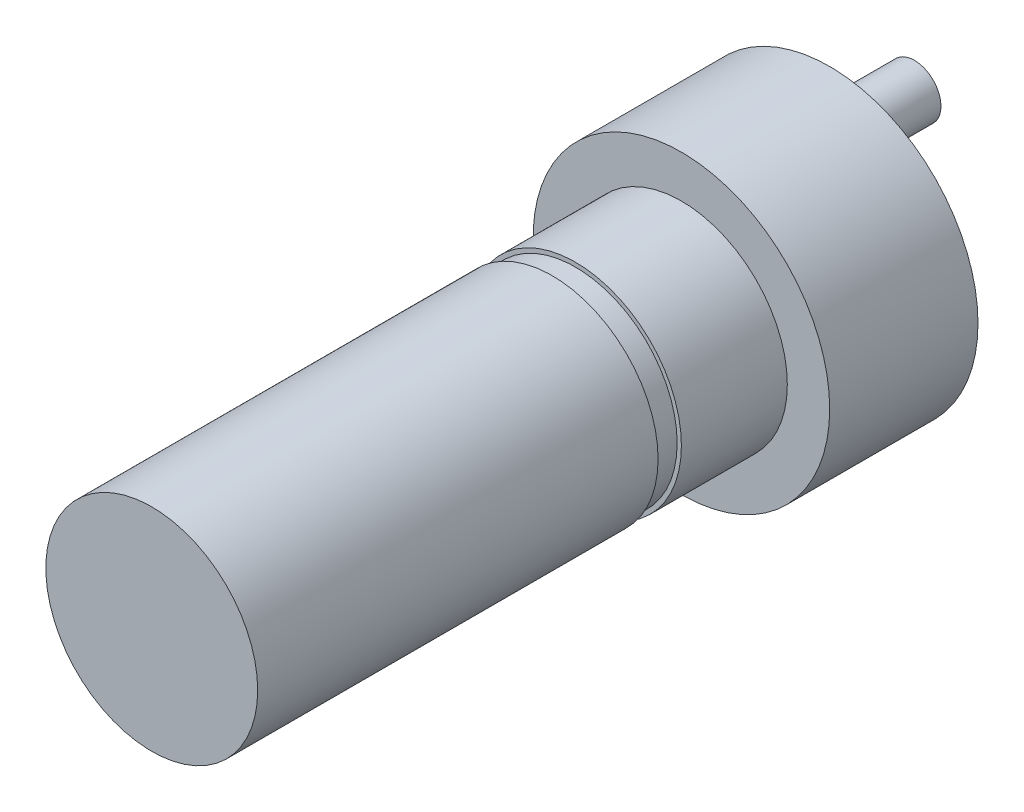
ISO-10303-21;
HEADER;
FILE_DESCRIPTION(('STEP AP214'),'2;1');
FILE_NAME('part.step','',(''),(''),'','','');
FILE_SCHEMA(('AUTOMOTIVE_DESIGN { 1 0 10303 214 1 1 1 1 }'));
ENDSEC;
DATA;
#1=APPLICATION_CONTEXT('core data for automotive mechanical design processes');
#2=APPLICATION_PROTOCOL_DEFINITION('international standard','automotive_design',2000,#1);
#3=PRODUCT_CONTEXT('',#1,'mechanical');
#4=PRODUCT('Part','Part','',(#3));
#5=PRODUCT_RELATED_PRODUCT_CATEGORY('part','',(#4));
#6=PRODUCT_DEFINITION_FORMATION('','',#4);
#7=PRODUCT_DEFINITION_CONTEXT('part definition',#1,'design');
#8=PRODUCT_DEFINITION('design','',#6,#7);
#9=PRODUCT_DEFINITION_SHAPE('','',#8);
#10=(LENGTH_UNIT() NAMED_UNIT(*) SI_UNIT(.MILLI.,.METRE.));
#11=(NAMED_UNIT(*) PLANE_ANGLE_UNIT() SI_UNIT($,.RADIAN.));
#12=(NAMED_UNIT(*) SI_UNIT($,.STERADIAN.) SOLID_ANGLE_UNIT());
#13=UNCERTAINTY_MEASURE_WITH_UNIT(LENGTH_MEASURE(1.E-05),#10,'distance_accuracy_value','');
#14=(GEOMETRIC_REPRESENTATION_CONTEXT(3) GLOBAL_UNCERTAINTY_ASSIGNED_CONTEXT((#13)) GLOBAL_UNIT_ASSIGNED_CONTEXT((#10,
#11,#12)) REPRESENTATION_CONTEXT('',''));
#15=CARTESIAN_POINT('',(0.,0.,0.));
#16=DIRECTION('',(0.,0.,1.));
#17=DIRECTION('',(1.,0.,0.));
#18=AXIS2_PLACEMENT_3D('',#15,#16,#17);
#19=CARTESIAN_POINT('',(0.,0.,25.));
#20=DIRECTION('',(0.,0.,-1.));
#21=DIRECTION('',(-1.,0.,0.));
#22=AXIS2_PLACEMENT_3D('',#19,#20,#21);
#23=CYLINDRICAL_SURFACE('',#22,5.);
#24=CARTESIAN_POINT('',(0.,0.,0.));
#25=DIRECTION('',(0.,0.,1.));
#26=DIRECTION('',(1.,0.,0.));
#27=AXIS2_PLACEMENT_3D('',#24,#25,#26);
#28=CIRCLE('',#27,5.);
#29=CARTESIAN_POINT('',(5.,0.,0.));
#30=VERTEX_POINT('',#29);
#31=EDGE_CURVE('E51',#30,#30,#28,.T.);
#32=ORIENTED_EDGE('',*,*,#31,.T.);
#33=EDGE_LOOP('',(#32));
#34=FACE_BOUND('',#33,.T.);
#35=CARTESIAN_POINT('',(0.,0.,5.));
#36=DIRECTION('',(0.,0.,1.));
#37=DIRECTION('',(1.,0.,0.));
#38=AXIS2_PLACEMENT_3D('',#35,#36,#37);
#39=CIRCLE('',#38,5.);
#40=CARTESIAN_POINT('',(5.,0.,5.));
#41=VERTEX_POINT('',#40);
#42=EDGE_CURVE('E71',#41,#41,#39,.T.);
#43=ORIENTED_EDGE('',*,*,#42,.F.);
#44=EDGE_LOOP('',(#43));
#45=FACE_BOUND('',#44,.T.);
#46=ADVANCED_FACE('F43',(#34,#45),#23,.T.);
#47=CARTESIAN_POINT('',(0.,0.,-7.));
#48=DIRECTION('',(0.,0.,1.));
#49=DIRECTION('',(1.,0.,0.));
#50=AXIS2_PLACEMENT_3D('',#47,#48,#49);
#51=CYLINDRICAL_SURFACE('',#50,7.);
#52=CARTESIAN_POINT('',(0.,0.,-7.));
#53=DIRECTION('',(0.,0.,1.));
#54=DIRECTION('',(1.,0.,0.));
#55=AXIS2_PLACEMENT_3D('',#52,#53,#54);
#56=CIRCLE('',#55,7.);
#57=CARTESIAN_POINT('',(7.,0.,-7.));
#58=VERTEX_POINT('',#57);
#59=EDGE_CURVE('E56',#58,#58,#56,.T.);
#60=ORIENTED_EDGE('',*,*,#59,.T.);
#61=EDGE_LOOP('',(#60));
#62=FACE_BOUND('',#61,.T.);
#63=CARTESIAN_POINT('',(0.,0.,0.));
#64=DIRECTION('',(0.,0.,1.));
#65=DIRECTION('',(1.,0.,0.));
#66=AXIS2_PLACEMENT_3D('',#63,#64,#65);
#67=CIRCLE('',#66,7.);
#68=CARTESIAN_POINT('',(7.,0.,0.));
#69=VERTEX_POINT('',#68);
#70=EDGE_CURVE('E62',#69,#69,#67,.T.);
#71=ORIENTED_EDGE('',*,*,#70,.F.);
#72=EDGE_LOOP('',(#71));
#73=FACE_BOUND('',#72,.T.);
#74=ADVANCED_FACE('F45',(#62,#73),#51,.T.);
#75=CARTESIAN_POINT('',(0.,0.,-7.));
#76=DIRECTION('',(0.,0.,1.));
#77=DIRECTION('',(1.,0.,0.));
#78=AXIS2_PLACEMENT_3D('',#75,#76,#77);
#79=PLANE('',#78);
#80=CARTESIAN_POINT('',(0.,4.,-7.));
#81=DIRECTION('',(0.,0.,1.));
#82=DIRECTION('',(1.,0.,0.));
#83=AXIS2_PLACEMENT_3D('',#80,#81,#82);
#84=CIRCLE('',#83,1.25);
#85=CARTESIAN_POINT('',(1.25,4.,-7.));
#86=VERTEX_POINT('',#85);
#87=EDGE_CURVE('E10',#86,#86,#84,.F.);
#88=ORIENTED_EDGE('',*,*,#87,.F.);
#89=EDGE_LOOP('',(#88));
#90=FACE_BOUND('',#89,.T.);
#91=ORIENTED_EDGE('',*,*,#59,.F.);
#92=EDGE_LOOP('',(#91));
#93=FACE_BOUND('',#92,.T.);
#94=ADVANCED_FACE('F107',(#90,#93),#79,.F.);
#95=CARTESIAN_POINT('',(0.,0.,0.));
#96=DIRECTION('',(0.,0.,1.));
#97=DIRECTION('',(1.,0.,0.));
#98=AXIS2_PLACEMENT_3D('',#95,#96,#97);
#99=PLANE('',#98);
#100=ORIENTED_EDGE('',*,*,#31,.F.);
#101=EDGE_LOOP('',(#100));
#102=FACE_BOUND('',#101,.T.);
#103=ORIENTED_EDGE('',*,*,#70,.T.);
#104=EDGE_LOOP('',(#103));
#105=FACE_BOUND('',#104,.T.);
#106=ADVANCED_FACE('F121',(#102,#105),#99,.T.);
#107=CARTESIAN_POINT('',(0.,0.,6.1));
#108=DIRECTION('',(0.,0.,1.));
#109=DIRECTION('',(1.,0.,0.));
#110=AXIS2_PLACEMENT_3D('',#107,#108,#109);
#111=PLANE('',#110);
#112=CARTESIAN_POINT('',(0.,0.,6.1));
#113=DIRECTION('',(0.,0.,1.));
#114=DIRECTION('',(1.,0.,0.));
#115=AXIS2_PLACEMENT_3D('',#112,#113,#114);
#116=CIRCLE('',#115,4.8);
#117=CARTESIAN_POINT('',(4.8,0.,6.1));
#118=VERTEX_POINT('',#117);
#119=EDGE_CURVE('E75',#118,#118,#116,.T.);
#120=ORIENTED_EDGE('',*,*,#119,.T.);
#121=EDGE_LOOP('',(#120));
#122=FACE_BOUND('',#121,.T.);
#123=CARTESIAN_POINT('',(0.,0.,6.1));
#124=DIRECTION('',(0.,0.,1.));
#125=DIRECTION('',(1.,0.,0.));
#126=AXIS2_PLACEMENT_3D('',#123,#124,#125);
#127=CIRCLE('',#126,5.);
#128=CARTESIAN_POINT('',(5.,0.,6.1));
#129=VERTEX_POINT('',#128);
#130=EDGE_CURVE('E74',#129,#129,#127,.T.);
#131=ORIENTED_EDGE('',*,*,#130,.F.);
#132=EDGE_LOOP('',(#131));
#133=FACE_BOUND('',#132,.T.);
#134=ADVANCED_FACE('F114',(#122,#133),#111,.F.);
#135=CARTESIAN_POINT('',(0.,0.,5.));
#136=DIRECTION('',(0.,0.,1.));
#137=DIRECTION('',(1.,0.,0.));
#138=AXIS2_PLACEMENT_3D('',#135,#136,#137);
#139=PLANE('',#138);
#140=CARTESIAN_POINT('',(0.,0.,5.));
#141=DIRECTION('',(0.,0.,1.));
#142=DIRECTION('',(1.,0.,0.));
#143=AXIS2_PLACEMENT_3D('',#140,#141,#142);
#144=CIRCLE('',#143,4.8);
#145=CARTESIAN_POINT('',(4.8,0.,5.));
#146=VERTEX_POINT('',#145);
#147=EDGE_CURVE('E134',#146,#146,#144,.T.);
#148=ORIENTED_EDGE('',*,*,#147,.F.);
#149=EDGE_LOOP('',(#148));
#150=FACE_BOUND('',#149,.T.);
#151=ORIENTED_EDGE('',*,*,#42,.T.);
#152=EDGE_LOOP('',(#151));
#153=FACE_BOUND('',#152,.T.);
#154=ADVANCED_FACE('F112',(#150,#153),#139,.T.);
#155=CARTESIAN_POINT('',(0.,0.,6.1));
#156=DIRECTION('',(0.,0.,-1.));
#157=DIRECTION('',(-1.,0.,0.));
#158=AXIS2_PLACEMENT_3D('',#155,#156,#157);
#159=CYLINDRICAL_SURFACE('',#158,4.8);
#160=ORIENTED_EDGE('',*,*,#119,.F.);
#161=EDGE_LOOP('',(#160));
#162=FACE_BOUND('',#161,.T.);
#163=ORIENTED_EDGE('',*,*,#147,.T.);
#164=EDGE_LOOP('',(#163));
#165=FACE_BOUND('',#164,.T.);
#166=ADVANCED_FACE('F99',(#162,#165),#159,.T.);
#167=CARTESIAN_POINT('',(0.,0.,25.));
#168=DIRECTION('',(0.,0.,1.));
#169=DIRECTION('',(1.,0.,0.));
#170=AXIS2_PLACEMENT_3D('',#167,#168,#169);
#171=PLANE('',#170);
#172=CARTESIAN_POINT('',(0.,0.,25.));
#173=DIRECTION('',(0.,0.,1.));
#174=DIRECTION('',(1.,0.,0.));
#175=AXIS2_PLACEMENT_3D('',#172,#173,#174);
#176=CIRCLE('',#175,5.);
#177=CARTESIAN_POINT('',(5.,0.,25.));
#178=VERTEX_POINT('',#177);
#179=EDGE_CURVE('E65',#178,#178,#176,.T.);
#180=ORIENTED_EDGE('',*,*,#179,.T.);
#181=EDGE_LOOP('',(#180));
#182=FACE_BOUND('',#181,.T.);
#183=ADVANCED_FACE('F84',(#182),#171,.T.);
#184=ORIENTED_EDGE('',*,*,#130,.T.);
#185=EDGE_LOOP('',(#184));
#186=FACE_BOUND('',#185,.T.);
#187=ORIENTED_EDGE('',*,*,#179,.F.);
#188=EDGE_LOOP('',(#187));
#189=FACE_BOUND('',#188,.T.);
#190=ADVANCED_FACE('F86',(#186,#189),#23,.T.);
#191=CARTESIAN_POINT('',(0.,4.,-11.));
#192=DIRECTION('',(0.,0.,1.));
#193=DIRECTION('',(1.,0.,0.));
#194=AXIS2_PLACEMENT_3D('',#191,#192,#193);
#195=CYLINDRICAL_SURFACE('',#194,1.25);
#196=CARTESIAN_POINT('',(0.,4.,-11.));
#197=DIRECTION('',(0.,0.,-1.));
#198=DIRECTION('',(-1.,0.,0.));
#199=AXIS2_PLACEMENT_3D('',#196,#197,#198);
#200=CIRCLE('',#199,1.25);
#201=CARTESIAN_POINT('',(-1.25,4.,-11.));
#202=VERTEX_POINT('',#201);
#203=EDGE_CURVE('E132',#202,#202,#200,.T.);
#204=ORIENTED_EDGE('',*,*,#203,.F.);
#205=EDGE_LOOP('',(#204));
#206=FACE_BOUND('',#205,.T.);
#207=ORIENTED_EDGE('',*,*,#87,.T.);
#208=EDGE_LOOP('',(#207));
#209=FACE_BOUND('',#208,.T.);
#210=ADVANCED_FACE('F88',(#206,#209),#195,.T.);
#211=CARTESIAN_POINT('',(0.,4.,-11.));
#212=DIRECTION('',(0.,0.,-1.));
#213=DIRECTION('',(-1.,0.,0.));
#214=AXIS2_PLACEMENT_3D('',#211,#212,#213);
#215=PLANE('',#214);
#216=ORIENTED_EDGE('',*,*,#203,.T.);
#217=EDGE_LOOP('',(#216));
#218=FACE_BOUND('',#217,.T.);
#219=ADVANCED_FACE('F95',(#218),#215,.T.);
#220=CLOSED_SHELL('',(#46,#74,#94,#106,#134,#154,#166,#183,#190,#210,#219));
#221=MANIFOLD_SOLID_BREP('B2',#220);
#222=ADVANCED_BREP_SHAPE_REPRESENTATION('',(#18,#221),#14);
#223=SHAPE_DEFINITION_REPRESENTATION(#9,#222);
ENDSEC;
END-ISO-10303-21;
